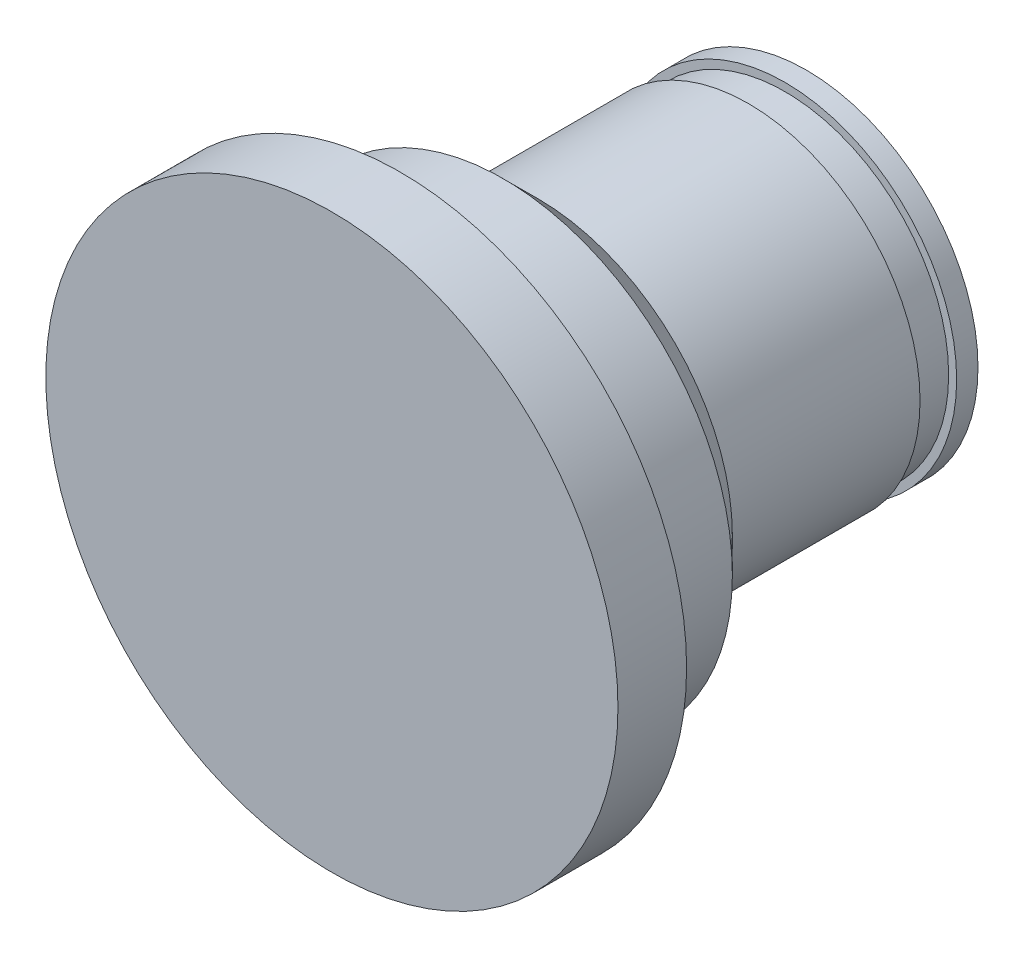
ISO-10303-21;
HEADER;
FILE_DESCRIPTION(('STEP AP214'),'2;1');
FILE_NAME('part.step','',(''),(''),'','','');
FILE_SCHEMA(('AUTOMOTIVE_DESIGN { 1 0 10303 214 1 1 1 1 }'));
ENDSEC;
DATA;
#1=APPLICATION_CONTEXT('core data for automotive mechanical design processes');
#2=APPLICATION_PROTOCOL_DEFINITION('international standard','automotive_design',2000,#1);
#3=PRODUCT_CONTEXT('',#1,'mechanical');
#4=PRODUCT('Part','Part','',(#3));
#5=PRODUCT_RELATED_PRODUCT_CATEGORY('part','',(#4));
#6=PRODUCT_DEFINITION_FORMATION('','',#4);
#7=PRODUCT_DEFINITION_CONTEXT('part definition',#1,'design');
#8=PRODUCT_DEFINITION('design','',#6,#7);
#9=PRODUCT_DEFINITION_SHAPE('','',#8);
#10=(LENGTH_UNIT() NAMED_UNIT(*) SI_UNIT(.MILLI.,.METRE.));
#11=(NAMED_UNIT(*) PLANE_ANGLE_UNIT() SI_UNIT($,.RADIAN.));
#12=(NAMED_UNIT(*) SI_UNIT($,.STERADIAN.) SOLID_ANGLE_UNIT());
#13=UNCERTAINTY_MEASURE_WITH_UNIT(LENGTH_MEASURE(1.E-05),#10,'distance_accuracy_value','');
#14=(GEOMETRIC_REPRESENTATION_CONTEXT(3) GLOBAL_UNCERTAINTY_ASSIGNED_CONTEXT((#13)) GLOBAL_UNIT_ASSIGNED_CONTEXT((#10,
#11,#12)) REPRESENTATION_CONTEXT('',''));
#15=CARTESIAN_POINT('',(0.,0.,0.));
#16=DIRECTION('',(0.,0.,1.));
#17=DIRECTION('',(1.,0.,0.));
#18=AXIS2_PLACEMENT_3D('',#15,#16,#17);
#19=CARTESIAN_POINT('',(0.,0.,0.));
#20=DIRECTION('',(0.,0.,1.));
#21=DIRECTION('',(1.,0.,0.));
#22=AXIS2_PLACEMENT_3D('',#19,#20,#21);
#23=PLANE('',#22);
#24=CARTESIAN_POINT('',(0.,0.,0.));
#25=DIRECTION('',(0.,0.,1.));
#26=DIRECTION('',(1.,0.,0.));
#27=AXIS2_PLACEMENT_3D('',#24,#25,#26);
#28=CIRCLE('',#27,12.5);
#29=CARTESIAN_POINT('',(12.5,0.,0.));
#30=VERTEX_POINT('',#29);
#31=EDGE_CURVE('E50',#30,#30,#28,.T.);
#32=ORIENTED_EDGE('',*,*,#31,.T.);
#33=EDGE_LOOP('',(#32));
#34=FACE_BOUND('',#33,.T.);
#35=ADVANCED_FACE('F30',(#34),#23,.T.);
#36=CARTESIAN_POINT('',(0.,0.,0.));
#37=DIRECTION('',(0.,0.,1.));
#38=DIRECTION('',(1.,0.,0.));
#39=AXIS2_PLACEMENT_3D('',#36,#37,#38);
#40=CYLINDRICAL_SURFACE('',#39,12.5);
#41=CARTESIAN_POINT('',(0.,0.,-3.));
#42=DIRECTION('',(0.,0.,1.));
#43=DIRECTION('',(1.,0.,0.));
#44=AXIS2_PLACEMENT_3D('',#41,#42,#43);
#45=CIRCLE('',#44,12.5);
#46=CARTESIAN_POINT('',(12.5,0.,-3.));
#47=VERTEX_POINT('',#46);
#48=EDGE_CURVE('E53',#47,#47,#45,.T.);
#49=ORIENTED_EDGE('',*,*,#48,.T.);
#50=EDGE_LOOP('',(#49));
#51=FACE_BOUND('',#50,.T.);
#52=ORIENTED_EDGE('',*,*,#31,.F.);
#53=EDGE_LOOP('',(#52));
#54=FACE_BOUND('',#53,.T.);
#55=ADVANCED_FACE('F93',(#51,#54),#40,.T.);
#56=CARTESIAN_POINT('',(12.5,0.,-3.));
#57=DIRECTION('',(0.,0.,-1.));
#58=DIRECTION('',(-1.,0.,0.));
#59=AXIS2_PLACEMENT_3D('',#56,#57,#58);
#60=PLANE('',#59);
#61=CARTESIAN_POINT('',(0.,0.,-3.));
#62=DIRECTION('',(0.,0.,1.));
#63=DIRECTION('',(1.,0.,0.));
#64=AXIS2_PLACEMENT_3D('',#61,#62,#63);
#65=CIRCLE('',#64,10.);
#66=CARTESIAN_POINT('',(10.,0.,-3.));
#67=VERTEX_POINT('',#66);
#68=EDGE_CURVE('E56',#67,#67,#65,.T.);
#69=ORIENTED_EDGE('',*,*,#68,.T.);
#70=EDGE_LOOP('',(#69));
#71=FACE_BOUND('',#70,.T.);
#72=ORIENTED_EDGE('',*,*,#48,.F.);
#73=EDGE_LOOP('',(#72));
#74=FACE_BOUND('',#73,.T.);
#75=ADVANCED_FACE('F99',(#71,#74),#60,.T.);
#76=CARTESIAN_POINT('',(0.,0.,0.));
#77=DIRECTION('',(0.,0.,1.));
#78=DIRECTION('',(1.,0.,0.));
#79=AXIS2_PLACEMENT_3D('',#76,#77,#78);
#80=CYLINDRICAL_SURFACE('',#79,10.);
#81=CARTESIAN_POINT('',(0.,0.,-7.5));
#82=DIRECTION('',(0.,0.,-1.));
#83=DIRECTION('',(-1.,0.,0.));
#84=AXIS2_PLACEMENT_3D('',#81,#82,#83);
#85=CIRCLE('',#84,10.);
#86=CARTESIAN_POINT('',(-10.,0.,-7.5));
#87=VERTEX_POINT('',#86);
#88=EDGE_CURVE('E37',#87,#87,#85,.F.);
#89=ORIENTED_EDGE('',*,*,#88,.T.);
#90=EDGE_LOOP('',(#89));
#91=FACE_BOUND('',#90,.T.);
#92=ORIENTED_EDGE('',*,*,#68,.F.);
#93=EDGE_LOOP('',(#92));
#94=FACE_BOUND('',#93,.T.);
#95=ADVANCED_FACE('F127',(#91,#94),#80,.T.);
#96=CARTESIAN_POINT('',(10.,0.,-9.));
#97=DIRECTION('',(0.,0.,-1.));
#98=DIRECTION('',(-1.,0.,0.));
#99=AXIS2_PLACEMENT_3D('',#96,#97,#98);
#100=PLANE('',#99);
#101=CARTESIAN_POINT('',(0.,0.,-9.));
#102=DIRECTION('',(0.,0.,-1.));
#103=DIRECTION('',(-1.,0.,0.));
#104=AXIS2_PLACEMENT_3D('',#101,#102,#103);
#105=CIRCLE('',#104,8.49999999999999);
#106=CARTESIAN_POINT('',(-8.49999999999999,0.,-9.));
#107=VERTEX_POINT('',#106);
#108=EDGE_CURVE('E10',#107,#107,#105,.T.);
#109=ORIENTED_EDGE('',*,*,#108,.T.);
#110=EDGE_LOOP('',(#109));
#111=FACE_BOUND('',#110,.T.);
#112=CARTESIAN_POINT('',(0.,0.,-9.));
#113=DIRECTION('',(0.,0.,1.));
#114=DIRECTION('',(1.,0.,0.));
#115=AXIS2_PLACEMENT_3D('',#112,#113,#114);
#116=CIRCLE('',#115,7.5);
#117=CARTESIAN_POINT('',(7.5,0.,-9.));
#118=VERTEX_POINT('',#117);
#119=EDGE_CURVE('E59',#118,#118,#116,.T.);
#120=ORIENTED_EDGE('',*,*,#119,.T.);
#121=EDGE_LOOP('',(#120));
#122=FACE_BOUND('',#121,.T.);
#123=ADVANCED_FACE('F121',(#111,#122),#100,.T.);
#124=CARTESIAN_POINT('',(0.,0.,0.));
#125=DIRECTION('',(0.,0.,1.));
#126=DIRECTION('',(1.,0.,0.));
#127=AXIS2_PLACEMENT_3D('',#124,#125,#126);
#128=CYLINDRICAL_SURFACE('',#127,7.5);
#129=CARTESIAN_POINT('',(0.,0.,-18.2));
#130=DIRECTION('',(0.,0.,1.));
#131=DIRECTION('',(1.,0.,0.));
#132=AXIS2_PLACEMENT_3D('',#129,#130,#131);
#133=CIRCLE('',#132,7.5);
#134=CARTESIAN_POINT('',(7.5,0.,-18.2));
#135=VERTEX_POINT('',#134);
#136=EDGE_CURVE('E62',#135,#135,#133,.T.);
#137=ORIENTED_EDGE('',*,*,#136,.T.);
#138=EDGE_LOOP('',(#137));
#139=FACE_BOUND('',#138,.T.);
#140=ORIENTED_EDGE('',*,*,#119,.F.);
#141=EDGE_LOOP('',(#140));
#142=FACE_BOUND('',#141,.T.);
#143=ADVANCED_FACE('F126',(#139,#142),#128,.T.);
#144=CARTESIAN_POINT('',(7.5,0.,-18.2));
#145=DIRECTION('',(0.,0.,-1.));
#146=DIRECTION('',(-1.,0.,0.));
#147=AXIS2_PLACEMENT_3D('',#144,#145,#146);
#148=PLANE('',#147);
#149=CARTESIAN_POINT('',(0.,0.,-18.2));
#150=DIRECTION('',(0.,0.,1.));
#151=DIRECTION('',(1.,0.,0.));
#152=AXIS2_PLACEMENT_3D('',#149,#150,#151);
#153=CIRCLE('',#152,7.15);
#154=CARTESIAN_POINT('',(7.15,0.,-18.2));
#155=VERTEX_POINT('',#154);
#156=EDGE_CURVE('E65',#155,#155,#153,.T.);
#157=ORIENTED_EDGE('',*,*,#156,.T.);
#158=EDGE_LOOP('',(#157));
#159=FACE_BOUND('',#158,.T.);
#160=ORIENTED_EDGE('',*,*,#136,.F.);
#161=EDGE_LOOP('',(#160));
#162=FACE_BOUND('',#161,.T.);
#163=ADVANCED_FACE('F167',(#159,#162),#148,.T.);
#164=CARTESIAN_POINT('',(0.,0.,0.));
#165=DIRECTION('',(0.,0.,1.));
#166=DIRECTION('',(1.,0.,0.));
#167=AXIS2_PLACEMENT_3D('',#164,#165,#166);
#168=CYLINDRICAL_SURFACE('',#167,7.15);
#169=CARTESIAN_POINT('',(0.,0.,-19.8));
#170=DIRECTION('',(0.,0.,1.));
#171=DIRECTION('',(1.,0.,0.));
#172=AXIS2_PLACEMENT_3D('',#169,#170,#171);
#173=CIRCLE('',#172,7.15);
#174=CARTESIAN_POINT('',(7.15,0.,-19.8));
#175=VERTEX_POINT('',#174);
#176=EDGE_CURVE('E68',#175,#175,#173,.T.);
#177=ORIENTED_EDGE('',*,*,#176,.T.);
#178=EDGE_LOOP('',(#177));
#179=FACE_BOUND('',#178,.T.);
#180=ORIENTED_EDGE('',*,*,#156,.F.);
#181=EDGE_LOOP('',(#180));
#182=FACE_BOUND('',#181,.T.);
#183=ADVANCED_FACE('F90',(#179,#182),#168,.T.);
#184=CARTESIAN_POINT('',(7.15,0.,-19.8));
#185=DIRECTION('',(0.,0.,1.));
#186=DIRECTION('',(1.,0.,0.));
#187=AXIS2_PLACEMENT_3D('',#184,#185,#186);
#188=PLANE('',#187);
#189=CARTESIAN_POINT('',(0.,0.,-19.8));
#190=DIRECTION('',(0.,0.,1.));
#191=DIRECTION('',(1.,0.,0.));
#192=AXIS2_PLACEMENT_3D('',#189,#190,#191);
#193=CIRCLE('',#192,7.5);
#194=CARTESIAN_POINT('',(7.5,0.,-19.8));
#195=VERTEX_POINT('',#194);
#196=EDGE_CURVE('E71',#195,#195,#193,.T.);
#197=ORIENTED_EDGE('',*,*,#196,.T.);
#198=EDGE_LOOP('',(#197));
#199=FACE_BOUND('',#198,.T.);
#200=ORIENTED_EDGE('',*,*,#176,.F.);
#201=EDGE_LOOP('',(#200));
#202=FACE_BOUND('',#201,.T.);
#203=ADVANCED_FACE('F75',(#199,#202),#188,.T.);
#204=CARTESIAN_POINT('',(0.,0.,0.));
#205=DIRECTION('',(0.,0.,1.));
#206=DIRECTION('',(1.,0.,0.));
#207=AXIS2_PLACEMENT_3D('',#204,#205,#206);
#208=CYLINDRICAL_SURFACE('',#207,7.5);
#209=CARTESIAN_POINT('',(0.,0.,-20.7320508075689));
#210=DIRECTION('',(0.,0.,-1.));
#211=DIRECTION('',(-1.,0.,0.));
#212=AXIS2_PLACEMENT_3D('',#209,#210,#211);
#213=CIRCLE('',#212,7.5);
#214=CARTESIAN_POINT('',(-7.5,0.,-20.7320508075689));
#215=VERTEX_POINT('',#214);
#216=EDGE_CURVE('E45',#215,#215,#213,.F.);
#217=ORIENTED_EDGE('',*,*,#216,.T.);
#218=EDGE_LOOP('',(#217));
#219=FACE_BOUND('',#218,.T.);
#220=ORIENTED_EDGE('',*,*,#196,.F.);
#221=EDGE_LOOP('',(#220));
#222=FACE_BOUND('',#221,.T.);
#223=ADVANCED_FACE('F78',(#219,#222),#208,.T.);
#224=CARTESIAN_POINT('',(7.5,0.,-21.));
#225=DIRECTION('',(0.,0.,-1.));
#226=DIRECTION('',(-1.,0.,0.));
#227=AXIS2_PLACEMENT_3D('',#224,#225,#226);
#228=PLANE('',#227);
#229=CARTESIAN_POINT('',(0.,0.,-21.));
#230=DIRECTION('',(0.,0.,-1.));
#231=DIRECTION('',(-1.,0.,0.));
#232=AXIS2_PLACEMENT_3D('',#229,#230,#231);
#233=CIRCLE('',#232,6.49999999999998);
#234=CARTESIAN_POINT('',(-6.49999999999998,0.,-21.));
#235=VERTEX_POINT('',#234);
#236=EDGE_CURVE('E41',#235,#235,#233,.T.);
#237=ORIENTED_EDGE('',*,*,#236,.T.);
#238=EDGE_LOOP('',(#237));
#239=FACE_BOUND('',#238,.T.);
#240=ADVANCED_FACE('F80',(#239),#228,.T.);
#241=CARTESIAN_POINT('',(0.,0.,-20.7320508075689));
#242=DIRECTION('',(0.,0.,1.));
#243=DIRECTION('',(1.,0.,0.));
#244=AXIS2_PLACEMENT_3D('',#241,#242,#243);
#245=CONICAL_SURFACE('',#244,7.5,1.30899693899575);
#246=ORIENTED_EDGE('',*,*,#236,.F.);
#247=EDGE_LOOP('',(#246));
#248=FACE_BOUND('',#247,.T.);
#249=ORIENTED_EDGE('',*,*,#216,.F.);
#250=EDGE_LOOP('',(#249));
#251=FACE_BOUND('',#250,.T.);
#252=ADVANCED_FACE('F87',(#248,#251),#245,.T.);
#253=CARTESIAN_POINT('',(0.,0.,-7.5));
#254=DIRECTION('',(0.,0.,1.));
#255=DIRECTION('',(1.,0.,0.));
#256=AXIS2_PLACEMENT_3D('',#253,#254,#255);
#257=CONICAL_SURFACE('',#256,10.,0.785398163397451);
#258=ORIENTED_EDGE('',*,*,#108,.F.);
#259=EDGE_LOOP('',(#258));
#260=FACE_BOUND('',#259,.T.);
#261=ORIENTED_EDGE('',*,*,#88,.F.);
#262=EDGE_LOOP('',(#261));
#263=FACE_BOUND('',#262,.T.);
#264=ADVANCED_FACE('F32',(#260,#263),#257,.T.);
#265=CLOSED_SHELL('',(#35,#55,#75,#95,#123,#143,#163,#183,#203,#223,#240,#252,#264));
#266=MANIFOLD_SOLID_BREP('B2',#265);
#267=ADVANCED_BREP_SHAPE_REPRESENTATION('',(#18,#266),#14);
#268=SHAPE_DEFINITION_REPRESENTATION(#9,#267);
ENDSEC;
END-ISO-10303-21;
